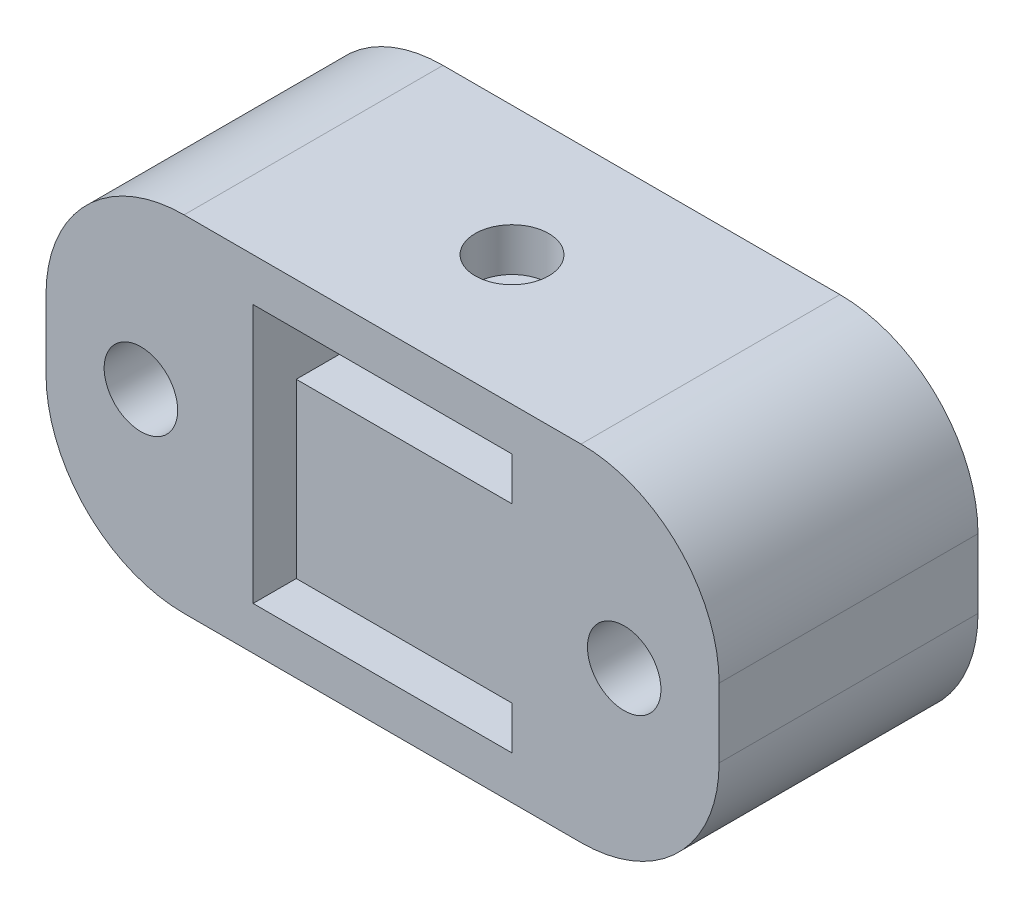
ISO-10303-21;
HEADER;
FILE_DESCRIPTION(('STEP AP214'),'2;1');
FILE_NAME('part.step','',(''),(''),'','','');
FILE_SCHEMA(('AUTOMOTIVE_DESIGN { 1 0 10303 214 1 1 1 1 }'));
ENDSEC;
DATA;
#1=APPLICATION_CONTEXT('core data for automotive mechanical design processes');
#2=APPLICATION_PROTOCOL_DEFINITION('international standard','automotive_design',2000,#1);
#3=PRODUCT_CONTEXT('',#1,'mechanical');
#4=PRODUCT('Part','Part','',(#3));
#5=PRODUCT_RELATED_PRODUCT_CATEGORY('part','',(#4));
#6=PRODUCT_DEFINITION_FORMATION('','',#4);
#7=PRODUCT_DEFINITION_CONTEXT('part definition',#1,'design');
#8=PRODUCT_DEFINITION('design','',#6,#7);
#9=PRODUCT_DEFINITION_SHAPE('','',#8);
#10=(LENGTH_UNIT() NAMED_UNIT(*) SI_UNIT(.MILLI.,.METRE.));
#11=(NAMED_UNIT(*) PLANE_ANGLE_UNIT() SI_UNIT($,.RADIAN.));
#12=(NAMED_UNIT(*) SI_UNIT($,.STERADIAN.) SOLID_ANGLE_UNIT());
#13=UNCERTAINTY_MEASURE_WITH_UNIT(LENGTH_MEASURE(1.E-05),#10,'distance_accuracy_value','');
#14=(GEOMETRIC_REPRESENTATION_CONTEXT(3) GLOBAL_UNCERTAINTY_ASSIGNED_CONTEXT((#13)) GLOBAL_UNIT_ASSIGNED_CONTEXT((#10,
#11,#12)) REPRESENTATION_CONTEXT('',''));
#15=CARTESIAN_POINT('',(0.,0.,0.));
#16=DIRECTION('',(0.,0.,1.));
#17=DIRECTION('',(1.,0.,0.));
#18=AXIS2_PLACEMENT_3D('',#15,#16,#17);
#19=CARTESIAN_POINT('',(-12.3825,-6.35,9.525));
#20=DIRECTION('',(1.,0.,0.));
#21=DIRECTION('',(0.,0.,-1.));
#22=AXIS2_PLACEMENT_3D('',#19,#20,#21);
#23=PLANE('',#22);
#24=DIRECTION('',(0.,-1.,0.));
#25=VECTOR('',#24,1.);
#26=CARTESIAN_POINT('',(-12.3825,-6.35,0.));
#27=LINE('',#26,#25);
#28=CARTESIAN_POINT('',(-12.3825,1.27,0.));
#29=VERTEX_POINT('',#28);
#30=CARTESIAN_POINT('',(-12.3825,-1.27,0.));
#31=VERTEX_POINT('',#30);
#32=EDGE_CURVE('E219',#29,#31,#27,.T.);
#33=ORIENTED_EDGE('',*,*,#32,.T.);
#34=DIRECTION('',(0.,0.,-1.));
#35=VECTOR('',#34,1.);
#36=CARTESIAN_POINT('',(-12.3825,-1.27,9.525));
#37=LINE('',#36,#35);
#38=CARTESIAN_POINT('',(-12.3825,-1.27,9.525));
#39=VERTEX_POINT('',#38);
#40=EDGE_CURVE('E267',#31,#39,#37,.F.);
#41=ORIENTED_EDGE('',*,*,#40,.T.);
#42=DIRECTION('',(0.,-1.,0.));
#43=VECTOR('',#42,1.);
#44=CARTESIAN_POINT('',(-12.3825,-6.35,9.525));
#45=LINE('',#44,#43);
#46=CARTESIAN_POINT('',(-12.3825,1.27,9.525));
#47=VERTEX_POINT('',#46);
#48=EDGE_CURVE('E231',#47,#39,#45,.T.);
#49=ORIENTED_EDGE('',*,*,#48,.F.);
#50=DIRECTION('',(0.,0.,-1.));
#51=VECTOR('',#50,1.);
#52=CARTESIAN_POINT('',(-12.3825,1.27,9.525));
#53=LINE('',#52,#51);
#54=EDGE_CURVE('E264',#47,#29,#53,.T.);
#55=ORIENTED_EDGE('',*,*,#54,.T.);
#56=EDGE_LOOP('',(#33,#41,#49,#55));
#57=FACE_BOUND('',#56,.T.);
#58=ADVANCED_FACE('F37',(#57),#23,.F.);
#59=CARTESIAN_POINT('',(12.3825,-6.35,9.525));
#60=DIRECTION('',(0.,1.,0.));
#61=DIRECTION('',(-1.,0.,0.));
#62=AXIS2_PLACEMENT_3D('',#59,#60,#61);
#63=PLANE('',#62);
#64=DIRECTION('',(1.,0.,0.));
#65=VECTOR('',#64,1.);
#66=CARTESIAN_POINT('',(12.3825,-6.35,9.525));
#67=LINE('',#66,#65);
#68=CARTESIAN_POINT('',(-7.3025,-6.35,9.525));
#69=VERTEX_POINT('',#68);
#70=CARTESIAN_POINT('',(7.3025,-6.35,9.525));
#71=VERTEX_POINT('',#70);
#72=EDGE_CURVE('E234',#69,#71,#67,.T.);
#73=ORIENTED_EDGE('',*,*,#72,.F.);
#74=DIRECTION('',(0.,0.,-1.));
#75=VECTOR('',#74,1.);
#76=CARTESIAN_POINT('',(-7.3025,-6.35,9.525));
#77=LINE('',#76,#75);
#78=CARTESIAN_POINT('',(-7.3025,-6.35,0.));
#79=VERTEX_POINT('',#78);
#80=EDGE_CURVE('E253',#69,#79,#77,.T.);
#81=ORIENTED_EDGE('',*,*,#80,.T.);
#82=DIRECTION('',(1.,0.,0.));
#83=VECTOR('',#82,1.);
#84=CARTESIAN_POINT('',(12.3825,-6.35,0.));
#85=LINE('',#84,#83);
#86=CARTESIAN_POINT('',(7.3025,-6.35,0.));
#87=VERTEX_POINT('',#86);
#88=EDGE_CURVE('E245',#79,#87,#85,.T.);
#89=ORIENTED_EDGE('',*,*,#88,.T.);
#90=DIRECTION('',(0.,0.,-1.));
#91=VECTOR('',#90,1.);
#92=CARTESIAN_POINT('',(7.3025,-6.35,9.525));
#93=LINE('',#92,#91);
#94=EDGE_CURVE('E242',#87,#71,#93,.F.);
#95=ORIENTED_EDGE('',*,*,#94,.T.);
#96=EDGE_LOOP('',(#73,#81,#89,#95));
#97=FACE_BOUND('',#96,.T.);
#98=ADVANCED_FACE('F309',(#97),#63,.F.);
#99=CARTESIAN_POINT('',(12.3825,-6.35,9.525));
#100=DIRECTION('',(-1.,0.,0.));
#101=DIRECTION('',(0.,0.,1.));
#102=AXIS2_PLACEMENT_3D('',#99,#100,#101);
#103=PLANE('',#102);
#104=DIRECTION('',(0.,1.,0.));
#105=VECTOR('',#104,1.);
#106=CARTESIAN_POINT('',(12.3825,-6.35,9.525));
#107=LINE('',#106,#105);
#108=CARTESIAN_POINT('',(12.3825,-1.27,9.525));
#109=VERTEX_POINT('',#108);
#110=CARTESIAN_POINT('',(12.3825,1.27,9.525));
#111=VERTEX_POINT('',#110);
#112=EDGE_CURVE('E238',#109,#111,#107,.T.);
#113=ORIENTED_EDGE('',*,*,#112,.F.);
#114=DIRECTION('',(0.,0.,-1.));
#115=VECTOR('',#114,1.);
#116=CARTESIAN_POINT('',(12.3825,-1.27,9.525));
#117=LINE('',#116,#115);
#118=CARTESIAN_POINT('',(12.3825,-1.27,0.));
#119=VERTEX_POINT('',#118);
#120=EDGE_CURVE('E278',#109,#119,#117,.T.);
#121=ORIENTED_EDGE('',*,*,#120,.T.);
#122=DIRECTION('',(0.,1.,0.));
#123=VECTOR('',#122,1.);
#124=CARTESIAN_POINT('',(12.3825,-6.35,0.));
#125=LINE('',#124,#123);
#126=CARTESIAN_POINT('',(12.3825,1.27,0.));
#127=VERTEX_POINT('',#126);
#128=EDGE_CURVE('E248',#119,#127,#125,.T.);
#129=ORIENTED_EDGE('',*,*,#128,.T.);
#130=DIRECTION('',(0.,0.,-1.));
#131=VECTOR('',#130,1.);
#132=CARTESIAN_POINT('',(12.3825,1.27,9.525));
#133=LINE('',#132,#131);
#134=EDGE_CURVE('E276',#127,#111,#133,.F.);
#135=ORIENTED_EDGE('',*,*,#134,.T.);
#136=EDGE_LOOP('',(#113,#121,#129,#135));
#137=FACE_BOUND('',#136,.T.);
#138=ADVANCED_FACE('F285',(#137),#103,.F.);
#139=CARTESIAN_POINT('',(12.3825,6.35,9.525));
#140=DIRECTION('',(0.,-1.,0.));
#141=DIRECTION('',(1.,0.,0.));
#142=AXIS2_PLACEMENT_3D('',#139,#140,#141);
#143=PLANE('',#142);
#144=CARTESIAN_POINT('',(0.,6.35,4.7625));
#145=DIRECTION('',(0.,1.,0.));
#146=DIRECTION('',(0.,0.,1.));
#147=AXIS2_PLACEMENT_3D('',#144,#145,#146);
#148=CIRCLE('',#147,1.35254999999999);
#149=CARTESIAN_POINT('',(0.,6.35,6.11504999999999));
#150=VERTEX_POINT('',#149);
#151=EDGE_CURVE('E396',#150,#150,#148,.T.);
#152=ORIENTED_EDGE('',*,*,#151,.F.);
#153=EDGE_LOOP('',(#152));
#154=FACE_BOUND('',#153,.T.);
#155=DIRECTION('',(-1.,0.,0.));
#156=VECTOR('',#155,1.);
#157=CARTESIAN_POINT('',(12.3825,6.35,9.525));
#158=LINE('',#157,#156);
#159=CARTESIAN_POINT('',(7.3025,6.35,9.525));
#160=VERTEX_POINT('',#159);
#161=CARTESIAN_POINT('',(-7.3025,6.35,9.525));
#162=VERTEX_POINT('',#161);
#163=EDGE_CURVE('E240',#160,#162,#158,.T.);
#164=ORIENTED_EDGE('',*,*,#163,.F.);
#165=DIRECTION('',(0.,0.,-1.));
#166=VECTOR('',#165,1.);
#167=CARTESIAN_POINT('',(7.3025,6.35,9.525));
#168=LINE('',#167,#166);
#169=CARTESIAN_POINT('',(7.3025,6.35,0.));
#170=VERTEX_POINT('',#169);
#171=EDGE_CURVE('E11',#160,#170,#168,.T.);
#172=ORIENTED_EDGE('',*,*,#171,.T.);
#173=DIRECTION('',(-1.,0.,0.));
#174=VECTOR('',#173,1.);
#175=CARTESIAN_POINT('',(12.3825,6.35,0.));
#176=LINE('',#175,#174);
#177=CARTESIAN_POINT('',(-7.3025,6.35,0.));
#178=VERTEX_POINT('',#177);
#179=EDGE_CURVE('E235',#170,#178,#176,.T.);
#180=ORIENTED_EDGE('',*,*,#179,.T.);
#181=DIRECTION('',(0.,0.,-1.));
#182=VECTOR('',#181,1.);
#183=CARTESIAN_POINT('',(-7.3025,6.35,9.525));
#184=LINE('',#183,#182);
#185=EDGE_CURVE('E46',#178,#162,#184,.F.);
#186=ORIENTED_EDGE('',*,*,#185,.T.);
#187=EDGE_LOOP('',(#164,#172,#180,#186));
#188=FACE_BOUND('',#187,.T.);
#189=ADVANCED_FACE('F294',(#154,#188),#143,.F.);
#190=CARTESIAN_POINT('',(0.,0.,9.525));
#191=DIRECTION('',(0.,0.,1.));
#192=DIRECTION('',(1.,0.,0.));
#193=AXIS2_PLACEMENT_3D('',#190,#191,#192);
#194=PLANE('',#193);
#195=CARTESIAN_POINT('',(-8.89,0.,9.525));
#196=DIRECTION('',(0.,0.,1.));
#197=DIRECTION('',(1.,0.,0.));
#198=AXIS2_PLACEMENT_3D('',#195,#196,#197);
#199=CIRCLE('',#198,1.35254999999999);
#200=CARTESIAN_POINT('',(-7.53745000000001,0.,9.525));
#201=VERTEX_POINT('',#200);
#202=EDGE_CURVE('E414',#201,#201,#199,.T.);
#203=ORIENTED_EDGE('',*,*,#202,.F.);
#204=EDGE_LOOP('',(#203));
#205=FACE_BOUND('',#204,.T.);
#206=CARTESIAN_POINT('',(8.89,0.,9.525));
#207=DIRECTION('',(0.,0.,1.));
#208=DIRECTION('',(1.,0.,0.));
#209=AXIS2_PLACEMENT_3D('',#206,#207,#208);
#210=CIRCLE('',#209,1.35254999999999);
#211=CARTESIAN_POINT('',(10.24255,0.,9.525));
#212=VERTEX_POINT('',#211);
#213=EDGE_CURVE('E419',#212,#212,#210,.T.);
#214=ORIENTED_EDGE('',*,*,#213,.F.);
#215=EDGE_LOOP('',(#214));
#216=FACE_BOUND('',#215,.T.);
#217=DIRECTION('',(0.,1.,0.));
#218=VECTOR('',#217,1.);
#219=CARTESIAN_POINT('',(4.7625,4.7625,9.525));
#220=LINE('',#219,#218);
#221=CARTESIAN_POINT('',(4.7625,3.175,9.525));
#222=VERTEX_POINT('',#221);
#223=CARTESIAN_POINT('',(4.7625,4.7625,9.525));
#224=VERTEX_POINT('',#223);
#225=EDGE_CURVE('E159',#222,#224,#220,.T.);
#226=ORIENTED_EDGE('',*,*,#225,.F.);
#227=DIRECTION('',(1.,0.,0.));
#228=VECTOR('',#227,1.);
#229=CARTESIAN_POINT('',(4.7625,3.175,9.525));
#230=LINE('',#229,#228);
#231=CARTESIAN_POINT('',(-3.175,3.175,9.525));
#232=VERTEX_POINT('',#231);
#233=EDGE_CURVE('E178',#232,#222,#230,.T.);
#234=ORIENTED_EDGE('',*,*,#233,.F.);
#235=DIRECTION('',(0.,1.,0.));
#236=VECTOR('',#235,1.);
#237=CARTESIAN_POINT('',(-3.175,3.175,9.525));
#238=LINE('',#237,#236);
#239=CARTESIAN_POINT('',(-3.175,-3.175,9.525));
#240=VERTEX_POINT('',#239);
#241=EDGE_CURVE('E181',#240,#232,#238,.T.);
#242=ORIENTED_EDGE('',*,*,#241,.F.);
#243=DIRECTION('',(-1.,0.,0.));
#244=VECTOR('',#243,1.);
#245=CARTESIAN_POINT('',(4.7625,-3.175,9.525));
#246=LINE('',#245,#244);
#247=CARTESIAN_POINT('',(4.7625,-3.175,9.525));
#248=VERTEX_POINT('',#247);
#249=EDGE_CURVE('E212',#248,#240,#246,.T.);
#250=ORIENTED_EDGE('',*,*,#249,.F.);
#251=DIRECTION('',(0.,1.,0.));
#252=VECTOR('',#251,1.);
#253=CARTESIAN_POINT('',(4.7625,-4.7625,9.525));
#254=LINE('',#253,#252);
#255=CARTESIAN_POINT('',(4.7625,-4.7625,9.525));
#256=VERTEX_POINT('',#255);
#257=EDGE_CURVE('E209',#256,#248,#254,.T.);
#258=ORIENTED_EDGE('',*,*,#257,.F.);
#259=DIRECTION('',(1.,0.,0.));
#260=VECTOR('',#259,1.);
#261=CARTESIAN_POINT('',(4.7625,-4.7625,9.525));
#262=LINE('',#261,#260);
#263=CARTESIAN_POINT('',(-4.7625,-4.7625,9.525));
#264=VERTEX_POINT('',#263);
#265=EDGE_CURVE('E206',#264,#256,#262,.T.);
#266=ORIENTED_EDGE('',*,*,#265,.F.);
#267=DIRECTION('',(0.,-1.,0.));
#268=VECTOR('',#267,1.);
#269=CARTESIAN_POINT('',(-4.7625,4.7625,9.525));
#270=LINE('',#269,#268);
#271=CARTESIAN_POINT('',(-4.7625,4.7625,9.525));
#272=VERTEX_POINT('',#271);
#273=EDGE_CURVE('E203',#272,#264,#270,.T.);
#274=ORIENTED_EDGE('',*,*,#273,.F.);
#275=DIRECTION('',(-1.,0.,0.));
#276=VECTOR('',#275,1.);
#277=CARTESIAN_POINT('',(4.7625,4.7625,9.525));
#278=LINE('',#277,#276);
#279=EDGE_CURVE('E201',#224,#272,#278,.T.);
#280=ORIENTED_EDGE('',*,*,#279,.F.);
#281=EDGE_LOOP('',(#226,#234,#242,#250,#258,#266,#274,#280));
#282=FACE_BOUND('',#281,.T.);
#283=ORIENTED_EDGE('',*,*,#48,.T.);
#284=CARTESIAN_POINT('',(-7.3025,-1.27,9.525));
#285=DIRECTION('',(0.,0.,1.));
#286=DIRECTION('',(1.,0.,0.));
#287=AXIS2_PLACEMENT_3D('',#284,#285,#286);
#288=CIRCLE('',#287,5.08);
#289=EDGE_CURVE('E274',#39,#69,#288,.T.);
#290=ORIENTED_EDGE('',*,*,#289,.T.);
#291=ORIENTED_EDGE('',*,*,#72,.T.);
#292=CARTESIAN_POINT('',(7.3025,-1.27,9.525));
#293=DIRECTION('',(0.,0.,1.));
#294=DIRECTION('',(1.,0.,0.));
#295=AXIS2_PLACEMENT_3D('',#292,#293,#294);
#296=CIRCLE('',#295,5.08);
#297=EDGE_CURVE('E272',#71,#109,#296,.T.);
#298=ORIENTED_EDGE('',*,*,#297,.T.);
#299=ORIENTED_EDGE('',*,*,#112,.T.);
#300=CARTESIAN_POINT('',(7.3025,1.27,9.525));
#301=DIRECTION('',(0.,0.,1.));
#302=DIRECTION('',(1.,0.,0.));
#303=AXIS2_PLACEMENT_3D('',#300,#301,#302);
#304=CIRCLE('',#303,5.08);
#305=EDGE_CURVE('E59',#111,#160,#304,.T.);
#306=ORIENTED_EDGE('',*,*,#305,.T.);
#307=ORIENTED_EDGE('',*,*,#163,.T.);
#308=CARTESIAN_POINT('',(-7.3025,1.27,9.525));
#309=DIRECTION('',(0.,0.,1.));
#310=DIRECTION('',(1.,0.,0.));
#311=AXIS2_PLACEMENT_3D('',#308,#309,#310);
#312=CIRCLE('',#311,5.08);
#313=EDGE_CURVE('E269',#162,#47,#312,.T.);
#314=ORIENTED_EDGE('',*,*,#313,.T.);
#315=EDGE_LOOP('',(#283,#290,#291,#298,#299,#306,#307,#314));
#316=FACE_BOUND('',#315,.T.);
#317=ADVANCED_FACE('F296',(#205,#216,#282,#316),#194,.T.);
#318=CARTESIAN_POINT('',(0.,0.,0.));
#319=DIRECTION('',(0.,0.,1.));
#320=DIRECTION('',(1.,0.,0.));
#321=AXIS2_PLACEMENT_3D('',#318,#319,#320);
#322=PLANE('',#321);
#323=CARTESIAN_POINT('',(-8.89,0.,0.));
#324=DIRECTION('',(0.,0.,1.));
#325=DIRECTION('',(1.,0.,0.));
#326=AXIS2_PLACEMENT_3D('',#323,#324,#325);
#327=CIRCLE('',#326,1.35255);
#328=CARTESIAN_POINT('',(-7.53745,0.,0.));
#329=VERTEX_POINT('',#328);
#330=EDGE_CURVE('E417',#329,#329,#327,.T.);
#331=ORIENTED_EDGE('',*,*,#330,.T.);
#332=EDGE_LOOP('',(#331));
#333=FACE_BOUND('',#332,.T.);
#334=CARTESIAN_POINT('',(8.89,0.,0.));
#335=DIRECTION('',(0.,0.,1.));
#336=DIRECTION('',(1.,0.,0.));
#337=AXIS2_PLACEMENT_3D('',#334,#335,#336);
#338=CIRCLE('',#337,1.35255);
#339=CARTESIAN_POINT('',(10.24255,0.,0.));
#340=VERTEX_POINT('',#339);
#341=EDGE_CURVE('E184',#340,#340,#338,.T.);
#342=ORIENTED_EDGE('',*,*,#341,.T.);
#343=EDGE_LOOP('',(#342));
#344=FACE_BOUND('',#343,.T.);
#345=DIRECTION('',(1.,0.,0.));
#346=VECTOR('',#345,1.);
#347=CARTESIAN_POINT('',(4.7625,3.175,0.));
#348=LINE('',#347,#346);
#349=CARTESIAN_POINT('',(-3.175,3.175,0.));
#350=VERTEX_POINT('',#349);
#351=CARTESIAN_POINT('',(4.7625,3.175,0.));
#352=VERTEX_POINT('',#351);
#353=EDGE_CURVE('E164',#350,#352,#348,.T.);
#354=ORIENTED_EDGE('',*,*,#353,.T.);
#355=DIRECTION('',(0.,1.,0.));
#356=VECTOR('',#355,1.);
#357=CARTESIAN_POINT('',(4.7625,4.7625,0.));
#358=LINE('',#357,#356);
#359=CARTESIAN_POINT('',(4.7625,4.7625,0.));
#360=VERTEX_POINT('',#359);
#361=EDGE_CURVE('E156',#352,#360,#358,.T.);
#362=ORIENTED_EDGE('',*,*,#361,.T.);
#363=DIRECTION('',(-1.,0.,0.));
#364=VECTOR('',#363,1.);
#365=CARTESIAN_POINT('',(4.7625,4.7625,0.));
#366=LINE('',#365,#364);
#367=CARTESIAN_POINT('',(-4.7625,4.7625,0.));
#368=VERTEX_POINT('',#367);
#369=EDGE_CURVE('E168',#360,#368,#366,.T.);
#370=ORIENTED_EDGE('',*,*,#369,.T.);
#371=DIRECTION('',(0.,-1.,0.));
#372=VECTOR('',#371,1.);
#373=CARTESIAN_POINT('',(-4.7625,4.7625,0.));
#374=LINE('',#373,#372);
#375=CARTESIAN_POINT('',(-4.7625,-4.7625,0.));
#376=VERTEX_POINT('',#375);
#377=EDGE_CURVE('E172',#368,#376,#374,.T.);
#378=ORIENTED_EDGE('',*,*,#377,.T.);
#379=DIRECTION('',(1.,0.,0.));
#380=VECTOR('',#379,1.);
#381=CARTESIAN_POINT('',(4.7625,-4.7625,0.));
#382=LINE('',#381,#380);
#383=CARTESIAN_POINT('',(4.7625,-4.7625,0.));
#384=VERTEX_POINT('',#383);
#385=EDGE_CURVE('E188',#376,#384,#382,.T.);
#386=ORIENTED_EDGE('',*,*,#385,.T.);
#387=DIRECTION('',(0.,1.,0.));
#388=VECTOR('',#387,1.);
#389=CARTESIAN_POINT('',(4.7625,-4.7625,0.));
#390=LINE('',#389,#388);
#391=CARTESIAN_POINT('',(4.7625,-3.175,0.));
#392=VERTEX_POINT('',#391);
#393=EDGE_CURVE('E191',#384,#392,#390,.T.);
#394=ORIENTED_EDGE('',*,*,#393,.T.);
#395=DIRECTION('',(-1.,0.,0.));
#396=VECTOR('',#395,1.);
#397=CARTESIAN_POINT('',(4.7625,-3.175,0.));
#398=LINE('',#397,#396);
#399=CARTESIAN_POINT('',(-3.175,-3.175,0.));
#400=VERTEX_POINT('',#399);
#401=EDGE_CURVE('E194',#392,#400,#398,.T.);
#402=ORIENTED_EDGE('',*,*,#401,.T.);
#403=DIRECTION('',(0.,1.,0.));
#404=VECTOR('',#403,1.);
#405=CARTESIAN_POINT('',(-3.175,3.175,0.));
#406=LINE('',#405,#404);
#407=EDGE_CURVE('E197',#400,#350,#406,.T.);
#408=ORIENTED_EDGE('',*,*,#407,.T.);
#409=EDGE_LOOP('',(#354,#362,#370,#378,#386,#394,#402,#408));
#410=FACE_BOUND('',#409,.T.);
#411=ORIENTED_EDGE('',*,*,#88,.F.);
#412=CARTESIAN_POINT('',(-7.3025,-1.27,0.));
#413=DIRECTION('',(0.,0.,1.));
#414=DIRECTION('',(1.,0.,0.));
#415=AXIS2_PLACEMENT_3D('',#412,#413,#414);
#416=CIRCLE('',#415,5.08);
#417=EDGE_CURVE('E262',#79,#31,#416,.F.);
#418=ORIENTED_EDGE('',*,*,#417,.T.);
#419=ORIENTED_EDGE('',*,*,#32,.F.);
#420=CARTESIAN_POINT('',(-7.3025,1.27,0.));
#421=DIRECTION('',(0.,0.,1.));
#422=DIRECTION('',(1.,0.,0.));
#423=AXIS2_PLACEMENT_3D('',#420,#421,#422);
#424=CIRCLE('',#423,5.08);
#425=EDGE_CURVE('E256',#29,#178,#424,.F.);
#426=ORIENTED_EDGE('',*,*,#425,.T.);
#427=ORIENTED_EDGE('',*,*,#179,.F.);
#428=CARTESIAN_POINT('',(7.3025,1.27,0.));
#429=DIRECTION('',(0.,0.,1.));
#430=DIRECTION('',(1.,0.,0.));
#431=AXIS2_PLACEMENT_3D('',#428,#429,#430);
#432=CIRCLE('',#431,5.08);
#433=EDGE_CURVE('E258',#170,#127,#432,.F.);
#434=ORIENTED_EDGE('',*,*,#433,.T.);
#435=ORIENTED_EDGE('',*,*,#128,.F.);
#436=CARTESIAN_POINT('',(7.3025,-1.27,0.));
#437=DIRECTION('',(0.,0.,1.));
#438=DIRECTION('',(1.,0.,0.));
#439=AXIS2_PLACEMENT_3D('',#436,#437,#438);
#440=CIRCLE('',#439,5.08);
#441=EDGE_CURVE('E260',#119,#87,#440,.F.);
#442=ORIENTED_EDGE('',*,*,#441,.T.);
#443=EDGE_LOOP('',(#411,#418,#419,#426,#427,#434,#435,#442));
#444=FACE_BOUND('',#443,.T.);
#445=ADVANCED_FACE('F174',(#333,#344,#410,#444),#322,.F.);
#446=CARTESIAN_POINT('',(4.7625,4.7625,0.));
#447=DIRECTION('',(1.,0.,0.));
#448=DIRECTION('',(0.,0.,-1.));
#449=AXIS2_PLACEMENT_3D('',#446,#447,#448);
#450=PLANE('',#449);
#451=ORIENTED_EDGE('',*,*,#225,.T.);
#452=DIRECTION('',(0.,0.,1.));
#453=VECTOR('',#452,1.);
#454=CARTESIAN_POINT('',(4.7625,4.7625,0.));
#455=LINE('',#454,#453);
#456=EDGE_CURVE('E152',#360,#224,#455,.T.);
#457=ORIENTED_EDGE('',*,*,#456,.F.);
#458=ORIENTED_EDGE('',*,*,#361,.F.);
#459=DIRECTION('',(0.,0.,1.));
#460=VECTOR('',#459,1.);
#461=CARTESIAN_POINT('',(4.7625,3.175,0.));
#462=LINE('',#461,#460);
#463=EDGE_CURVE('E217',#352,#222,#462,.T.);
#464=ORIENTED_EDGE('',*,*,#463,.T.);
#465=EDGE_LOOP('',(#451,#457,#458,#464));
#466=FACE_BOUND('',#465,.T.);
#467=ADVANCED_FACE('F154',(#466),#450,.F.);
#468=CARTESIAN_POINT('',(4.7625,3.175,0.));
#469=DIRECTION('',(0.,-1.,0.));
#470=DIRECTION('',(1.,0.,0.));
#471=AXIS2_PLACEMENT_3D('',#468,#469,#470);
#472=PLANE('',#471);
#473=CARTESIAN_POINT('',(0.,3.175,4.7625));
#474=DIRECTION('',(0.,-1.,0.));
#475=DIRECTION('',(1.,0.,0.));
#476=AXIS2_PLACEMENT_3D('',#473,#474,#475);
#477=CIRCLE('',#476,1.35254999999999);
#478=CARTESIAN_POINT('',(1.35254999999999,3.175,4.7625));
#479=VERTEX_POINT('',#478);
#480=EDGE_CURVE('E411',#479,#479,#477,.T.);
#481=ORIENTED_EDGE('',*,*,#480,.T.);
#482=EDGE_LOOP('',(#481));
#483=FACE_BOUND('',#482,.T.);
#484=ORIENTED_EDGE('',*,*,#233,.T.);
#485=ORIENTED_EDGE('',*,*,#463,.F.);
#486=ORIENTED_EDGE('',*,*,#353,.F.);
#487=DIRECTION('',(0.,0.,1.));
#488=VECTOR('',#487,1.);
#489=CARTESIAN_POINT('',(-3.175,3.175,0.));
#490=LINE('',#489,#488);
#491=EDGE_CURVE('E220',#350,#232,#490,.T.);
#492=ORIENTED_EDGE('',*,*,#491,.T.);
#493=EDGE_LOOP('',(#484,#485,#486,#492));
#494=FACE_BOUND('',#493,.T.);
#495=ADVANCED_FACE('F339',(#483,#494),#472,.F.);
#496=CARTESIAN_POINT('',(-3.175,3.175,0.));
#497=DIRECTION('',(1.,0.,0.));
#498=DIRECTION('',(0.,0.,-1.));
#499=AXIS2_PLACEMENT_3D('',#496,#497,#498);
#500=PLANE('',#499);
#501=ORIENTED_EDGE('',*,*,#241,.T.);
#502=ORIENTED_EDGE('',*,*,#491,.F.);
#503=ORIENTED_EDGE('',*,*,#407,.F.);
#504=DIRECTION('',(0.,0.,1.));
#505=VECTOR('',#504,1.);
#506=CARTESIAN_POINT('',(-3.175,-3.175,0.));
#507=LINE('',#506,#505);
#508=EDGE_CURVE('E222',#400,#240,#507,.T.);
#509=ORIENTED_EDGE('',*,*,#508,.T.);
#510=EDGE_LOOP('',(#501,#502,#503,#509));
#511=FACE_BOUND('',#510,.T.);
#512=ADVANCED_FACE('F358',(#511),#500,.F.);
#513=CARTESIAN_POINT('',(4.7625,-3.175,0.));
#514=DIRECTION('',(0.,1.,0.));
#515=DIRECTION('',(-1.,0.,0.));
#516=AXIS2_PLACEMENT_3D('',#513,#514,#515);
#517=PLANE('',#516);
#518=CARTESIAN_POINT('',(0.,-3.175,4.7625));
#519=DIRECTION('',(0.,1.,0.));
#520=DIRECTION('',(-1.,0.,0.));
#521=AXIS2_PLACEMENT_3D('',#518,#519,#520);
#522=CIRCLE('',#521,1.35254999999999);
#523=CARTESIAN_POINT('',(-1.35254999999999,-3.175,4.7625));
#524=VERTEX_POINT('',#523);
#525=EDGE_CURVE('E402',#524,#524,#522,.T.);
#526=ORIENTED_EDGE('',*,*,#525,.T.);
#527=EDGE_LOOP('',(#526));
#528=FACE_BOUND('',#527,.T.);
#529=ORIENTED_EDGE('',*,*,#249,.T.);
#530=ORIENTED_EDGE('',*,*,#508,.F.);
#531=ORIENTED_EDGE('',*,*,#401,.F.);
#532=DIRECTION('',(0.,0.,1.));
#533=VECTOR('',#532,1.);
#534=CARTESIAN_POINT('',(4.7625,-3.175,0.));
#535=LINE('',#534,#533);
#536=EDGE_CURVE('E224',#392,#248,#535,.T.);
#537=ORIENTED_EDGE('',*,*,#536,.T.);
#538=EDGE_LOOP('',(#529,#530,#531,#537));
#539=FACE_BOUND('',#538,.T.);
#540=ADVANCED_FACE('F354',(#528,#539),#517,.F.);
#541=CARTESIAN_POINT('',(4.7625,-4.7625,0.));
#542=DIRECTION('',(1.,0.,0.));
#543=DIRECTION('',(0.,0.,-1.));
#544=AXIS2_PLACEMENT_3D('',#541,#542,#543);
#545=PLANE('',#544);
#546=ORIENTED_EDGE('',*,*,#257,.T.);
#547=ORIENTED_EDGE('',*,*,#536,.F.);
#548=ORIENTED_EDGE('',*,*,#393,.F.);
#549=DIRECTION('',(0.,0.,1.));
#550=VECTOR('',#549,1.);
#551=CARTESIAN_POINT('',(4.7625,-4.7625,0.));
#552=LINE('',#551,#550);
#553=EDGE_CURVE('E226',#384,#256,#552,.T.);
#554=ORIENTED_EDGE('',*,*,#553,.T.);
#555=EDGE_LOOP('',(#546,#547,#548,#554));
#556=FACE_BOUND('',#555,.T.);
#557=ADVANCED_FACE('F350',(#556),#545,.F.);
#558=CARTESIAN_POINT('',(4.7625,-4.7625,0.));
#559=DIRECTION('',(0.,-1.,0.));
#560=DIRECTION('',(0.,0.,-1.));
#561=AXIS2_PLACEMENT_3D('',#558,#559,#560);
#562=PLANE('',#561);
#563=CARTESIAN_POINT('',(0.,-4.7625,4.7625));
#564=DIRECTION('',(0.,-1.,0.));
#565=DIRECTION('',(0.,0.,-1.));
#566=AXIS2_PLACEMENT_3D('',#563,#564,#565);
#567=CIRCLE('',#566,1.35254999999999);
#568=CARTESIAN_POINT('',(0.,-4.7625,3.40995000000001));
#569=VERTEX_POINT('',#568);
#570=EDGE_CURVE('E399',#569,#569,#567,.T.);
#571=ORIENTED_EDGE('',*,*,#570,.T.);
#572=EDGE_LOOP('',(#571));
#573=FACE_BOUND('',#572,.T.);
#574=ORIENTED_EDGE('',*,*,#265,.T.);
#575=ORIENTED_EDGE('',*,*,#553,.F.);
#576=ORIENTED_EDGE('',*,*,#385,.F.);
#577=DIRECTION('',(0.,0.,1.));
#578=VECTOR('',#577,1.);
#579=CARTESIAN_POINT('',(-4.7625,-4.7625,0.));
#580=LINE('',#579,#578);
#581=EDGE_CURVE('E228',#376,#264,#580,.T.);
#582=ORIENTED_EDGE('',*,*,#581,.T.);
#583=EDGE_LOOP('',(#574,#575,#576,#582));
#584=FACE_BOUND('',#583,.T.);
#585=ADVANCED_FACE('F346',(#573,#584),#562,.F.);
#586=CARTESIAN_POINT('',(-4.7625,4.7625,0.));
#587=DIRECTION('',(-1.,0.,0.));
#588=DIRECTION('',(0.,0.,1.));
#589=AXIS2_PLACEMENT_3D('',#586,#587,#588);
#590=PLANE('',#589);
#591=ORIENTED_EDGE('',*,*,#273,.T.);
#592=ORIENTED_EDGE('',*,*,#581,.F.);
#593=ORIENTED_EDGE('',*,*,#377,.F.);
#594=DIRECTION('',(0.,0.,1.));
#595=VECTOR('',#594,1.);
#596=CARTESIAN_POINT('',(-4.7625,4.7625,0.));
#597=LINE('',#596,#595);
#598=EDGE_CURVE('E163',#368,#272,#597,.T.);
#599=ORIENTED_EDGE('',*,*,#598,.T.);
#600=EDGE_LOOP('',(#591,#592,#593,#599));
#601=FACE_BOUND('',#600,.T.);
#602=ADVANCED_FACE('F342',(#601),#590,.F.);
#603=CARTESIAN_POINT('',(4.7625,4.7625,0.));
#604=DIRECTION('',(0.,1.,0.));
#605=DIRECTION('',(0.,0.,1.));
#606=AXIS2_PLACEMENT_3D('',#603,#604,#605);
#607=PLANE('',#606);
#608=CARTESIAN_POINT('',(0.,4.7625,4.7625));
#609=DIRECTION('',(0.,1.,0.));
#610=DIRECTION('',(0.,0.,1.));
#611=AXIS2_PLACEMENT_3D('',#608,#609,#610);
#612=CIRCLE('',#611,1.35254999999999);
#613=CARTESIAN_POINT('',(0.,4.7625,6.11504999999999));
#614=VERTEX_POINT('',#613);
#615=EDGE_CURVE('E41',#614,#614,#612,.T.);
#616=ORIENTED_EDGE('',*,*,#615,.T.);
#617=EDGE_LOOP('',(#616));
#618=FACE_BOUND('',#617,.T.);
#619=ORIENTED_EDGE('',*,*,#279,.T.);
#620=ORIENTED_EDGE('',*,*,#598,.F.);
#621=ORIENTED_EDGE('',*,*,#369,.F.);
#622=ORIENTED_EDGE('',*,*,#456,.T.);
#623=EDGE_LOOP('',(#619,#620,#621,#622));
#624=FACE_BOUND('',#623,.T.);
#625=ADVANCED_FACE('F169',(#618,#624),#607,.F.);
#626=CARTESIAN_POINT('',(-7.3025,-1.27,9.525));
#627=DIRECTION('',(0.,0.,-1.));
#628=DIRECTION('',(-1.,0.,0.));
#629=AXIS2_PLACEMENT_3D('',#626,#627,#628);
#630=CYLINDRICAL_SURFACE('',#629,5.08);
#631=ORIENTED_EDGE('',*,*,#289,.F.);
#632=ORIENTED_EDGE('',*,*,#40,.F.);
#633=ORIENTED_EDGE('',*,*,#417,.F.);
#634=ORIENTED_EDGE('',*,*,#80,.F.);
#635=EDGE_LOOP('',(#631,#632,#633,#634));
#636=FACE_BOUND('',#635,.T.);
#637=ADVANCED_FACE('F306',(#636),#630,.T.);
#638=CARTESIAN_POINT('',(7.3025,-1.27,9.525));
#639=DIRECTION('',(0.,0.,-1.));
#640=DIRECTION('',(-1.,0.,0.));
#641=AXIS2_PLACEMENT_3D('',#638,#639,#640);
#642=CYLINDRICAL_SURFACE('',#641,5.08);
#643=ORIENTED_EDGE('',*,*,#297,.F.);
#644=ORIENTED_EDGE('',*,*,#94,.F.);
#645=ORIENTED_EDGE('',*,*,#441,.F.);
#646=ORIENTED_EDGE('',*,*,#120,.F.);
#647=EDGE_LOOP('',(#643,#644,#645,#646));
#648=FACE_BOUND('',#647,.T.);
#649=ADVANCED_FACE('F311',(#648),#642,.T.);
#650=CARTESIAN_POINT('',(7.3025,1.27,9.525));
#651=DIRECTION('',(0.,0.,-1.));
#652=DIRECTION('',(-1.,0.,0.));
#653=AXIS2_PLACEMENT_3D('',#650,#651,#652);
#654=CYLINDRICAL_SURFACE('',#653,5.08);
#655=ORIENTED_EDGE('',*,*,#305,.F.);
#656=ORIENTED_EDGE('',*,*,#134,.F.);
#657=ORIENTED_EDGE('',*,*,#433,.F.);
#658=ORIENTED_EDGE('',*,*,#171,.F.);
#659=EDGE_LOOP('',(#655,#656,#657,#658));
#660=FACE_BOUND('',#659,.T.);
#661=ADVANCED_FACE('F293',(#660),#654,.T.);
#662=CARTESIAN_POINT('',(-7.3025,1.27,9.525));
#663=DIRECTION('',(0.,0.,-1.));
#664=DIRECTION('',(-1.,0.,0.));
#665=AXIS2_PLACEMENT_3D('',#662,#663,#664);
#666=CYLINDRICAL_SURFACE('',#665,5.08);
#667=ORIENTED_EDGE('',*,*,#313,.F.);
#668=ORIENTED_EDGE('',*,*,#185,.F.);
#669=ORIENTED_EDGE('',*,*,#425,.F.);
#670=ORIENTED_EDGE('',*,*,#54,.F.);
#671=EDGE_LOOP('',(#667,#668,#669,#670));
#672=FACE_BOUND('',#671,.T.);
#673=ADVANCED_FACE('F39',(#672),#666,.T.);
#674=CARTESIAN_POINT('',(8.89,0.,9.525));
#675=DIRECTION('',(0.,0.,1.));
#676=DIRECTION('',(1.,0.,0.));
#677=AXIS2_PLACEMENT_3D('',#674,#675,#676);
#678=CYLINDRICAL_SURFACE('',#677,1.35254999999999);
#679=ORIENTED_EDGE('',*,*,#341,.F.);
#680=EDGE_LOOP('',(#679));
#681=FACE_BOUND('',#680,.T.);
#682=ORIENTED_EDGE('',*,*,#213,.T.);
#683=EDGE_LOOP('',(#682));
#684=FACE_BOUND('',#683,.T.);
#685=ADVANCED_FACE('F366',(#681,#684),#678,.F.);
#686=CARTESIAN_POINT('',(-8.89,0.,9.525));
#687=DIRECTION('',(0.,0.,1.));
#688=DIRECTION('',(1.,0.,0.));
#689=AXIS2_PLACEMENT_3D('',#686,#687,#688);
#690=CYLINDRICAL_SURFACE('',#689,1.35254999999999);
#691=ORIENTED_EDGE('',*,*,#330,.F.);
#692=EDGE_LOOP('',(#691));
#693=FACE_BOUND('',#692,.T.);
#694=ORIENTED_EDGE('',*,*,#202,.T.);
#695=EDGE_LOOP('',(#694));
#696=FACE_BOUND('',#695,.T.);
#697=ADVANCED_FACE('F369',(#693,#696),#690,.F.);
#698=CARTESIAN_POINT('',(0.,6.35,4.7625));
#699=DIRECTION('',(0.,1.,0.));
#700=DIRECTION('',(0.,0.,1.));
#701=AXIS2_PLACEMENT_3D('',#698,#699,#700);
#702=CYLINDRICAL_SURFACE('',#701,1.35254999999999);
#703=ORIENTED_EDGE('',*,*,#151,.T.);
#704=EDGE_LOOP('',(#703));
#705=FACE_BOUND('',#704,.T.);
#706=ORIENTED_EDGE('',*,*,#615,.F.);
#707=EDGE_LOOP('',(#706));
#708=FACE_BOUND('',#707,.T.);
#709=ADVANCED_FACE('F373',(#705,#708),#702,.F.);
#710=CARTESIAN_POINT('',(0.,-4.826,4.7625));
#711=DIRECTION('',(0.,-1.,0.));
#712=DIRECTION('',(0.,0.,-1.));
#713=AXIS2_PLACEMENT_3D('',#710,#711,#712);
#714=PLANE('',#713);
#715=CARTESIAN_POINT('',(0.,-4.82600000000001,4.7625));
#716=DIRECTION('',(0.,1.,0.));
#717=DIRECTION('',(0.,0.,1.));
#718=AXIS2_PLACEMENT_3D('',#715,#716,#717);
#719=CIRCLE('',#718,1.35254999999999);
#720=CARTESIAN_POINT('',(0.,-4.82600000000001,6.11504999999999));
#721=VERTEX_POINT('',#720);
#722=EDGE_CURVE('E400',#721,#721,#719,.T.);
#723=ORIENTED_EDGE('',*,*,#722,.T.);
#724=EDGE_LOOP('',(#723));
#725=FACE_BOUND('',#724,.T.);
#726=ADVANCED_FACE('F375',(#725),#714,.F.);
#727=ORIENTED_EDGE('',*,*,#722,.F.);
#728=EDGE_LOOP('',(#727));
#729=FACE_BOUND('',#728,.T.);
#730=ORIENTED_EDGE('',*,*,#570,.F.);
#731=EDGE_LOOP('',(#730));
#732=FACE_BOUND('',#731,.T.);
#733=ADVANCED_FACE('F378',(#729,#732),#702,.F.);
#734=ORIENTED_EDGE('',*,*,#525,.F.);
#735=EDGE_LOOP('',(#734));
#736=FACE_BOUND('',#735,.T.);
#737=ORIENTED_EDGE('',*,*,#480,.F.);
#738=EDGE_LOOP('',(#737));
#739=FACE_BOUND('',#738,.T.);
#740=ADVANCED_FACE('F380',(#736,#739),#702,.F.);
#741=CLOSED_SHELL('',(#58,#98,#138,#189,#317,#445,#467,#495,#512,#540,#557,#585,#602,#625,#637,
#649,#661,#673,#685,#697,#709,#726,#733,#740));
#742=MANIFOLD_SOLID_BREP('B2',#741);
#743=ADVANCED_BREP_SHAPE_REPRESENTATION('',(#18,#742),#14);
#744=SHAPE_DEFINITION_REPRESENTATION(#9,#743);
ENDSEC;
END-ISO-10303-21;
